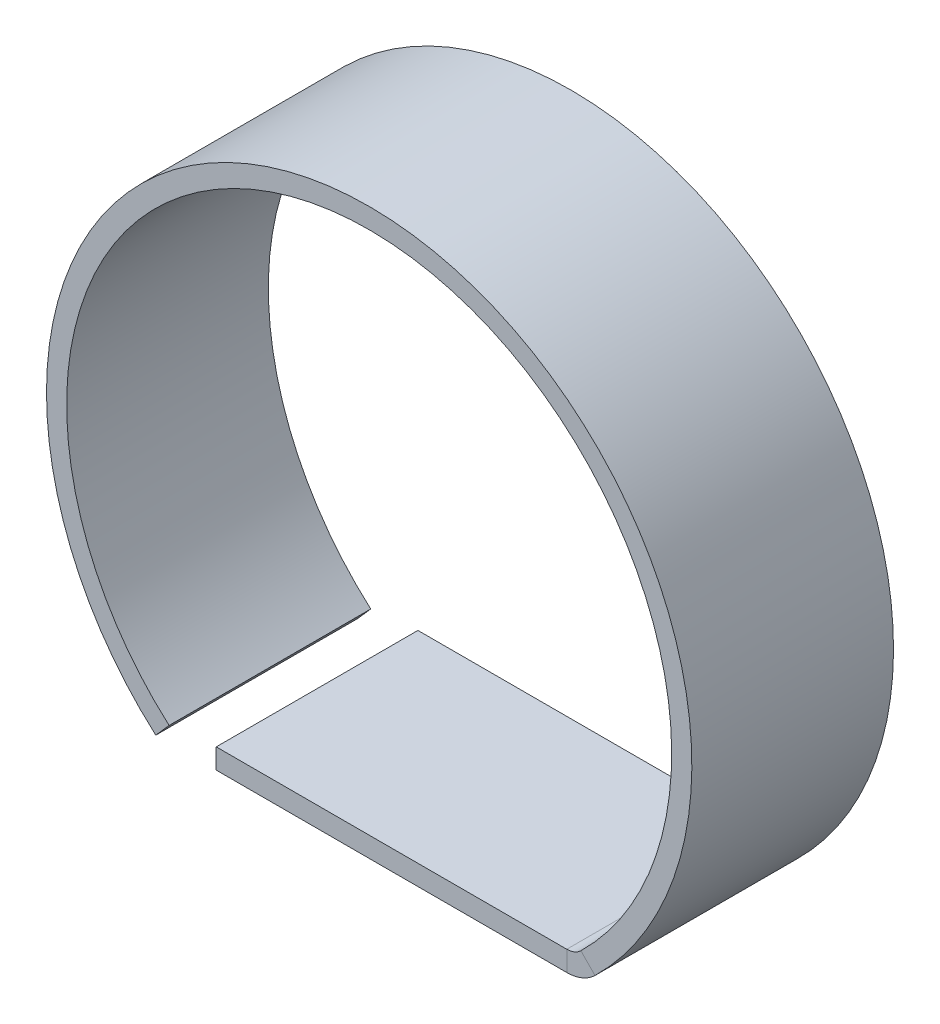
ISO-10303-21;
HEADER;
FILE_DESCRIPTION(('STEP AP214'),'2;1');
FILE_NAME('part.step','',(''),(''),'','','');
FILE_SCHEMA(('AUTOMOTIVE_DESIGN { 1 0 10303 214 1 1 1 1 }'));
ENDSEC;
DATA;
#1=APPLICATION_CONTEXT('core data for automotive mechanical design processes');
#2=APPLICATION_PROTOCOL_DEFINITION('international standard','automotive_design',2000,#1);
#3=PRODUCT_CONTEXT('',#1,'mechanical');
#4=PRODUCT('Part','Part','',(#3));
#5=PRODUCT_RELATED_PRODUCT_CATEGORY('part','',(#4));
#6=PRODUCT_DEFINITION_FORMATION('','',#4);
#7=PRODUCT_DEFINITION_CONTEXT('part definition',#1,'design');
#8=PRODUCT_DEFINITION('design','',#6,#7);
#9=PRODUCT_DEFINITION_SHAPE('','',#8);
#10=(LENGTH_UNIT() NAMED_UNIT(*) SI_UNIT(.MILLI.,.METRE.));
#11=(NAMED_UNIT(*) PLANE_ANGLE_UNIT() SI_UNIT($,.RADIAN.));
#12=(NAMED_UNIT(*) SI_UNIT($,.STERADIAN.) SOLID_ANGLE_UNIT());
#13=UNCERTAINTY_MEASURE_WITH_UNIT(LENGTH_MEASURE(1.E-05),#10,'distance_accuracy_value','');
#14=(GEOMETRIC_REPRESENTATION_CONTEXT(3) GLOBAL_UNCERTAINTY_ASSIGNED_CONTEXT((#13)) GLOBAL_UNIT_ASSIGNED_CONTEXT((#10,
#11,#12)) REPRESENTATION_CONTEXT('',''));
#15=CARTESIAN_POINT('',(0.,0.,0.));
#16=DIRECTION('',(0.,0.,1.));
#17=DIRECTION('',(1.,0.,0.));
#18=AXIS2_PLACEMENT_3D('',#15,#16,#17);
#19=CARTESIAN_POINT('',(9.79795897113271,-12.,10.));
#20=DIRECTION('',(0.,0.,1.));
#21=DIRECTION('',(1.,0.,0.));
#22=AXIS2_PLACEMENT_3D('',#19,#20,#21);
#23=PLANE('',#22);
#24=DIRECTION('',(0.,1.,0.));
#25=VECTOR('',#24,1.);
#26=CARTESIAN_POINT('',(9.79795897113271,-12.,10.));
#27=LINE('',#26,#25);
#28=CARTESIAN_POINT('',(9.79795897113271,-12.,10.));
#29=VERTEX_POINT('',#28);
#30=CARTESIAN_POINT('',(9.79795897113271,-11.,10.));
#31=VERTEX_POINT('',#30);
#32=EDGE_CURVE('E11',#29,#31,#27,.T.);
#33=ORIENTED_EDGE('',*,*,#32,.F.);
#34=CARTESIAN_POINT('',(9.79795897113271,-10.,10.));
#35=DIRECTION('',(0.,0.,-1.));
#36=DIRECTION('',(-1.,0.,0.));
#37=AXIS2_PLACEMENT_3D('',#34,#35,#36);
#38=CIRCLE('',#37,2.);
#39=CARTESIAN_POINT('',(11.1976673955802,-11.4285714285714,10.));
#40=VERTEX_POINT('',#39);
#41=EDGE_CURVE('E136',#40,#29,#38,.T.);
#42=ORIENTED_EDGE('',*,*,#41,.F.);
#43=DIRECTION('',(0.699854212223765,-0.714285714285715,0.));
#44=VECTOR('',#43,1.);
#45=CARTESIAN_POINT('',(10.4978131833565,-10.7142857142857,10.));
#46=LINE('',#45,#44);
#47=CARTESIAN_POINT('',(10.4978131833565,-10.7142857142857,10.));
#48=VERTEX_POINT('',#47);
#49=EDGE_CURVE('E47',#48,#40,#46,.T.);
#50=ORIENTED_EDGE('',*,*,#49,.F.);
#51=CARTESIAN_POINT('',(9.79795897113271,-10.,10.));
#52=DIRECTION('',(0.,0.,1.));
#53=DIRECTION('',(1.,0.,0.));
#54=AXIS2_PLACEMENT_3D('',#51,#52,#53);
#55=CIRCLE('',#54,1.);
#56=EDGE_CURVE('E129',#48,#31,#55,.F.);
#57=ORIENTED_EDGE('',*,*,#56,.T.);
#58=EDGE_LOOP('',(#33,#42,#50,#57));
#59=FACE_BOUND('',#58,.T.);
#60=ADVANCED_FACE('F39',(#59),#23,.T.);
#61=CARTESIAN_POINT('',(10.4978131833565,-10.7142857142857,10.));
#62=DIRECTION('',(0.,0.,1.));
#63=DIRECTION('',(1.,0.,0.));
#64=AXIS2_PLACEMENT_3D('',#61,#62,#63);
#65=PLANE('',#64);
#66=DIRECTION('',(-1.,0.,0.));
#67=VECTOR('',#66,1.);
#68=CARTESIAN_POINT('',(10.5830052442584,-12.,10.));
#69=LINE('',#68,#67);
#70=CARTESIAN_POINT('',(-7.58300524425836,-12.,10.));
#71=VERTEX_POINT('',#70);
#72=EDGE_CURVE('E185',#29,#71,#69,.T.);
#73=ORIENTED_EDGE('',*,*,#72,.F.);
#74=ORIENTED_EDGE('',*,*,#32,.T.);
#75=DIRECTION('',(-1.,0.,0.));
#76=VECTOR('',#75,1.);
#77=CARTESIAN_POINT('',(10.5830052442584,-11.,10.));
#78=LINE('',#77,#76);
#79=CARTESIAN_POINT('',(-7.58300524425836,-11.,10.));
#80=VERTEX_POINT('',#79);
#81=EDGE_CURVE('E95',#31,#80,#78,.T.);
#82=ORIENTED_EDGE('',*,*,#81,.T.);
#83=DIRECTION('',(0.,1.,0.));
#84=VECTOR('',#83,1.);
#85=CARTESIAN_POINT('',(-7.58300524425836,-12.,10.));
#86=LINE('',#85,#84);
#87=EDGE_CURVE('E342',#71,#80,#86,.T.);
#88=ORIENTED_EDGE('',*,*,#87,.F.);
#89=EDGE_LOOP('',(#73,#74,#82,#88));
#90=FACE_BOUND('',#89,.T.);
#91=ADVANCED_FACE('F193',(#90),#65,.T.);
#92=CARTESIAN_POINT('',(11.1976673955802,-11.4285714285714,0.));
#93=DIRECTION('',(0.,0.,-1.));
#94=DIRECTION('',(-1.,0.,0.));
#95=AXIS2_PLACEMENT_3D('',#92,#93,#94);
#96=PLANE('',#95);
#97=DIRECTION('',(-0.699854212223765,0.714285714285715,0.));
#98=VECTOR('',#97,1.);
#99=CARTESIAN_POINT('',(11.1976673955802,-11.4285714285714,0.));
#100=LINE('',#99,#98);
#101=CARTESIAN_POINT('',(11.1976673955802,-11.4285714285714,0.));
#102=VERTEX_POINT('',#101);
#103=CARTESIAN_POINT('',(10.4978131833565,-10.7142857142857,0.));
#104=VERTEX_POINT('',#103);
#105=EDGE_CURVE('E82',#102,#104,#100,.T.);
#106=ORIENTED_EDGE('',*,*,#105,.F.);
#107=CARTESIAN_POINT('',(9.79795897113271,-10.,0.));
#108=DIRECTION('',(0.,0.,-1.));
#109=DIRECTION('',(-1.,0.,0.));
#110=AXIS2_PLACEMENT_3D('',#107,#108,#109);
#111=CIRCLE('',#110,2.);
#112=CARTESIAN_POINT('',(9.79795897113271,-12.,0.));
#113=VERTEX_POINT('',#112);
#114=EDGE_CURVE('E151',#102,#113,#111,.T.);
#115=ORIENTED_EDGE('',*,*,#114,.T.);
#116=DIRECTION('',(0.,-1.,0.));
#117=VECTOR('',#116,1.);
#118=CARTESIAN_POINT('',(9.79795897113271,-11.,0.));
#119=LINE('',#118,#117);
#120=CARTESIAN_POINT('',(9.79795897113271,-11.,0.));
#121=VERTEX_POINT('',#120);
#122=EDGE_CURVE('E89',#121,#113,#119,.T.);
#123=ORIENTED_EDGE('',*,*,#122,.F.);
#124=CARTESIAN_POINT('',(9.79795897113271,-10.,0.));
#125=DIRECTION('',(0.,0.,1.));
#126=DIRECTION('',(1.,0.,0.));
#127=AXIS2_PLACEMENT_3D('',#124,#125,#126);
#128=CIRCLE('',#127,1.);
#129=EDGE_CURVE('E158',#104,#121,#128,.F.);
#130=ORIENTED_EDGE('',*,*,#129,.F.);
#131=EDGE_LOOP('',(#106,#115,#123,#130));
#132=FACE_BOUND('',#131,.T.);
#133=ADVANCED_FACE('F191',(#132),#96,.T.);
#134=CARTESIAN_POINT('',(9.79795897113271,-11.,0.));
#135=DIRECTION('',(0.,0.,-1.));
#136=DIRECTION('',(-1.,0.,0.));
#137=AXIS2_PLACEMENT_3D('',#134,#135,#136);
#138=PLANE('',#137);
#139=CARTESIAN_POINT('',(0.,0.,0.));
#140=DIRECTION('',(0.,0.,-1.));
#141=DIRECTION('',(1.,0.,0.));
#142=AXIS2_PLACEMENT_3D('',#139,#140,#141);
#143=CIRCLE('',#142,16.);
#144=CARTESIAN_POINT('',(-10.5830052442584,-12.,0.));
#145=VERTEX_POINT('',#144);
#146=EDGE_CURVE('E153',#145,#102,#143,.T.);
#147=ORIENTED_EDGE('',*,*,#146,.T.);
#148=ORIENTED_EDGE('',*,*,#105,.T.);
#149=CARTESIAN_POINT('',(0.,0.,0.));
#150=DIRECTION('',(0.,0.,1.));
#151=DIRECTION('',(1.,0.,0.));
#152=AXIS2_PLACEMENT_3D('',#149,#150,#151);
#153=CIRCLE('',#152,15.);
#154=CARTESIAN_POINT('',(-9.92156741649221,-11.25,0.));
#155=VERTEX_POINT('',#154);
#156=EDGE_CURVE('E156',#155,#104,#153,.F.);
#157=ORIENTED_EDGE('',*,*,#156,.F.);
#158=DIRECTION('',(-0.661437827766143,-0.750000000000004,0.));
#159=VECTOR('',#158,1.);
#160=CARTESIAN_POINT('',(-9.92156741649221,-11.25,0.));
#161=LINE('',#160,#159);
#162=EDGE_CURVE('E117',#155,#145,#161,.T.);
#163=ORIENTED_EDGE('',*,*,#162,.T.);
#164=EDGE_LOOP('',(#147,#148,#157,#163));
#165=FACE_BOUND('',#164,.T.);
#166=ADVANCED_FACE('F187',(#165),#138,.T.);
#167=CARTESIAN_POINT('',(10.5830052442584,-11.,10.));
#168=DIRECTION('',(0.,-1.,0.));
#169=DIRECTION('',(1.,0.,0.));
#170=AXIS2_PLACEMENT_3D('',#167,#168,#169);
#171=PLANE('',#170);
#172=DIRECTION('',(-1.,0.,0.));
#173=VECTOR('',#172,1.);
#174=CARTESIAN_POINT('',(10.5830052442584,-11.,0.));
#175=LINE('',#174,#173);
#176=CARTESIAN_POINT('',(-7.58300524425836,-11.,0.));
#177=VERTEX_POINT('',#176);
#178=EDGE_CURVE('E142',#121,#177,#175,.T.);
#179=ORIENTED_EDGE('',*,*,#178,.T.);
#180=DIRECTION('',(0.,0.,-1.));
#181=VECTOR('',#180,1.);
#182=CARTESIAN_POINT('',(-7.58300524425836,-11.,10.));
#183=LINE('',#182,#181);
#184=EDGE_CURVE('E172',#80,#177,#183,.T.);
#185=ORIENTED_EDGE('',*,*,#184,.F.);
#186=ORIENTED_EDGE('',*,*,#81,.F.);
#187=DIRECTION('',(0.,0.,-1.));
#188=VECTOR('',#187,1.);
#189=CARTESIAN_POINT('',(9.79795897113271,-11.,10.));
#190=LINE('',#189,#188);
#191=EDGE_CURVE('E141',#31,#121,#190,.T.);
#192=ORIENTED_EDGE('',*,*,#191,.T.);
#193=EDGE_LOOP('',(#179,#185,#186,#192));
#194=FACE_BOUND('',#193,.T.);
#195=ADVANCED_FACE('F199',(#194),#171,.F.);
#196=CARTESIAN_POINT('',(-7.58300524425836,-12.,10.));
#197=DIRECTION('',(-1.,0.,0.));
#198=DIRECTION('',(0.,0.,1.));
#199=AXIS2_PLACEMENT_3D('',#196,#197,#198);
#200=PLANE('',#199);
#201=DIRECTION('',(0.,1.,0.));
#202=VECTOR('',#201,1.);
#203=CARTESIAN_POINT('',(-7.58300524425836,-12.,0.));
#204=LINE('',#203,#202);
#205=CARTESIAN_POINT('',(-7.58300524425836,-12.,0.));
#206=VERTEX_POINT('',#205);
#207=EDGE_CURVE('E145',#206,#177,#204,.T.);
#208=ORIENTED_EDGE('',*,*,#207,.F.);
#209=DIRECTION('',(0.,0.,-1.));
#210=VECTOR('',#209,1.);
#211=CARTESIAN_POINT('',(-7.58300524425836,-12.,10.));
#212=LINE('',#211,#210);
#213=EDGE_CURVE('E170',#71,#206,#212,.T.);
#214=ORIENTED_EDGE('',*,*,#213,.F.);
#215=ORIENTED_EDGE('',*,*,#87,.T.);
#216=ORIENTED_EDGE('',*,*,#184,.T.);
#217=EDGE_LOOP('',(#208,#214,#215,#216));
#218=FACE_BOUND('',#217,.T.);
#219=ADVANCED_FACE('F230',(#218),#200,.T.);
#220=CARTESIAN_POINT('',(10.5830052442584,-12.,10.));
#221=DIRECTION('',(0.,-1.,0.));
#222=DIRECTION('',(1.,0.,0.));
#223=AXIS2_PLACEMENT_3D('',#220,#221,#222);
#224=PLANE('',#223);
#225=DIRECTION('',(-1.,0.,0.));
#226=VECTOR('',#225,1.);
#227=CARTESIAN_POINT('',(10.5830052442584,-12.,0.));
#228=LINE('',#227,#226);
#229=EDGE_CURVE('E148',#113,#206,#228,.T.);
#230=ORIENTED_EDGE('',*,*,#229,.F.);
#231=DIRECTION('',(0.,0.,-1.));
#232=VECTOR('',#231,1.);
#233=CARTESIAN_POINT('',(9.79795897113271,-12.,10.));
#234=LINE('',#233,#232);
#235=EDGE_CURVE('E167',#29,#113,#234,.T.);
#236=ORIENTED_EDGE('',*,*,#235,.F.);
#237=ORIENTED_EDGE('',*,*,#72,.T.);
#238=ORIENTED_EDGE('',*,*,#213,.T.);
#239=EDGE_LOOP('',(#230,#236,#237,#238));
#240=FACE_BOUND('',#239,.T.);
#241=ADVANCED_FACE('F241',(#240),#224,.T.);
#242=CARTESIAN_POINT('',(9.79795897113271,-10.,10.));
#243=DIRECTION('',(0.,0.,-1.));
#244=DIRECTION('',(-1.,0.,0.));
#245=AXIS2_PLACEMENT_3D('',#242,#243,#244);
#246=CYLINDRICAL_SURFACE('',#245,2.);
#247=ORIENTED_EDGE('',*,*,#114,.F.);
#248=DIRECTION('',(0.,0.,-1.));
#249=VECTOR('',#248,1.);
#250=CARTESIAN_POINT('',(11.1976673955802,-11.4285714285714,10.));
#251=LINE('',#250,#249);
#252=EDGE_CURVE('E164',#40,#102,#251,.T.);
#253=ORIENTED_EDGE('',*,*,#252,.F.);
#254=ORIENTED_EDGE('',*,*,#41,.T.);
#255=ORIENTED_EDGE('',*,*,#235,.T.);
#256=EDGE_LOOP('',(#247,#253,#254,#255));
#257=FACE_BOUND('',#256,.T.);
#258=ADVANCED_FACE('F181',(#257),#246,.T.);
#259=CARTESIAN_POINT('',(0.,0.,10.));
#260=DIRECTION('',(0.,0.,-1.));
#261=DIRECTION('',(-1.,0.,0.));
#262=AXIS2_PLACEMENT_3D('',#259,#260,#261);
#263=CYLINDRICAL_SURFACE('',#262,16.);
#264=ORIENTED_EDGE('',*,*,#146,.F.);
#265=DIRECTION('',(0.,0.,-1.));
#266=VECTOR('',#265,1.);
#267=CARTESIAN_POINT('',(-10.5830052442584,-12.,10.));
#268=LINE('',#267,#266);
#269=CARTESIAN_POINT('',(-10.5830052442584,-12.,10.));
#270=VERTEX_POINT('',#269);
#271=EDGE_CURVE('E119',#270,#145,#268,.T.);
#272=ORIENTED_EDGE('',*,*,#271,.F.);
#273=CARTESIAN_POINT('',(0.,0.,10.));
#274=DIRECTION('',(0.,0.,-1.));
#275=DIRECTION('',(1.,0.,0.));
#276=AXIS2_PLACEMENT_3D('',#273,#274,#275);
#277=CIRCLE('',#276,16.);
#278=EDGE_CURVE('E134',#270,#40,#277,.T.);
#279=ORIENTED_EDGE('',*,*,#278,.T.);
#280=ORIENTED_EDGE('',*,*,#252,.T.);
#281=EDGE_LOOP('',(#264,#272,#279,#280));
#282=FACE_BOUND('',#281,.T.);
#283=ADVANCED_FACE('F186',(#282),#263,.T.);
#284=CARTESIAN_POINT('',(-9.92156741649221,-11.25,10.));
#285=DIRECTION('',(0.750000000000004,-0.661437827766143,0.));
#286=DIRECTION('',(0.661437827766143,0.750000000000004,0.));
#287=AXIS2_PLACEMENT_3D('',#284,#285,#286);
#288=PLANE('',#287);
#289=ORIENTED_EDGE('',*,*,#162,.F.);
#290=DIRECTION('',(0.,0.,-1.));
#291=VECTOR('',#290,1.);
#292=CARTESIAN_POINT('',(-9.92156741649221,-11.25,10.));
#293=LINE('',#292,#291);
#294=CARTESIAN_POINT('',(-9.92156741649221,-11.25,10.));
#295=VERTEX_POINT('',#294);
#296=EDGE_CURVE('E111',#295,#155,#293,.T.);
#297=ORIENTED_EDGE('',*,*,#296,.F.);
#298=DIRECTION('',(-0.661437827766143,-0.750000000000004,0.));
#299=VECTOR('',#298,1.);
#300=CARTESIAN_POINT('',(-9.92156741649221,-11.25,10.));
#301=LINE('',#300,#299);
#302=EDGE_CURVE('E115',#295,#270,#301,.T.);
#303=ORIENTED_EDGE('',*,*,#302,.T.);
#304=ORIENTED_EDGE('',*,*,#271,.T.);
#305=EDGE_LOOP('',(#289,#297,#303,#304));
#306=FACE_BOUND('',#305,.T.);
#307=ADVANCED_FACE('F113',(#306),#288,.T.);
#308=CARTESIAN_POINT('',(0.,0.,10.));
#309=DIRECTION('',(0.,0.,-1.));
#310=DIRECTION('',(-1.,0.,0.));
#311=AXIS2_PLACEMENT_3D('',#308,#309,#310);
#312=CYLINDRICAL_SURFACE('',#311,15.);
#313=ORIENTED_EDGE('',*,*,#156,.T.);
#314=DIRECTION('',(0.,0.,-1.));
#315=VECTOR('',#314,1.);
#316=CARTESIAN_POINT('',(10.4978131833565,-10.7142857142857,10.));
#317=LINE('',#316,#315);
#318=EDGE_CURVE('E120',#48,#104,#317,.T.);
#319=ORIENTED_EDGE('',*,*,#318,.F.);
#320=CARTESIAN_POINT('',(0.,0.,10.));
#321=DIRECTION('',(0.,0.,1.));
#322=DIRECTION('',(1.,0.,0.));
#323=AXIS2_PLACEMENT_3D('',#320,#321,#322);
#324=CIRCLE('',#323,15.);
#325=EDGE_CURVE('E124',#295,#48,#324,.F.);
#326=ORIENTED_EDGE('',*,*,#325,.F.);
#327=ORIENTED_EDGE('',*,*,#296,.T.);
#328=EDGE_LOOP('',(#313,#319,#326,#327));
#329=FACE_BOUND('',#328,.T.);
#330=ADVANCED_FACE('F125',(#329),#312,.F.);
#331=CARTESIAN_POINT('',(9.79795897113271,-10.,10.));
#332=DIRECTION('',(0.,0.,-1.));
#333=DIRECTION('',(-1.,0.,0.));
#334=AXIS2_PLACEMENT_3D('',#331,#332,#333);
#335=CYLINDRICAL_SURFACE('',#334,1.);
#336=ORIENTED_EDGE('',*,*,#129,.T.);
#337=ORIENTED_EDGE('',*,*,#191,.F.);
#338=ORIENTED_EDGE('',*,*,#56,.F.);
#339=ORIENTED_EDGE('',*,*,#318,.T.);
#340=EDGE_LOOP('',(#336,#337,#338,#339));
#341=FACE_BOUND('',#340,.T.);
#342=ADVANCED_FACE('F189',(#341),#335,.F.);
#343=CARTESIAN_POINT('',(9.79795897113271,-10.,10.));
#344=DIRECTION('',(0.,0.,-1.));
#345=DIRECTION('',(-1.,0.,0.));
#346=AXIS2_PLACEMENT_3D('',#343,#344,#345);
#347=PLANE('',#346);
#348=ORIENTED_EDGE('',*,*,#325,.T.);
#349=ORIENTED_EDGE('',*,*,#49,.T.);
#350=ORIENTED_EDGE('',*,*,#278,.F.);
#351=ORIENTED_EDGE('',*,*,#302,.F.);
#352=EDGE_LOOP('',(#348,#349,#350,#351));
#353=FACE_BOUND('',#352,.T.);
#354=ADVANCED_FACE('F132',(#353),#347,.F.);
#355=CARTESIAN_POINT('',(9.79795897113271,-10.,0.));
#356=DIRECTION('',(0.,0.,-1.));
#357=DIRECTION('',(-1.,0.,0.));
#358=AXIS2_PLACEMENT_3D('',#355,#356,#357);
#359=PLANE('',#358);
#360=ORIENTED_EDGE('',*,*,#178,.F.);
#361=ORIENTED_EDGE('',*,*,#122,.T.);
#362=ORIENTED_EDGE('',*,*,#229,.T.);
#363=ORIENTED_EDGE('',*,*,#207,.T.);
#364=EDGE_LOOP('',(#360,#361,#362,#363));
#365=FACE_BOUND('',#364,.T.);
#366=ADVANCED_FACE('F307',(#365),#359,.T.);
#367=CLOSED_SHELL('',(#60,#91,#133,#166,#195,#219,#241,#258,#283,#307,#330,#342,#354,#366));
#368=MANIFOLD_SOLID_BREP('B2',#367);
#369=ADVANCED_BREP_SHAPE_REPRESENTATION('',(#18,#368),#14);
#370=SHAPE_DEFINITION_REPRESENTATION(#9,#369);
ENDSEC;
END-ISO-10303-21;
